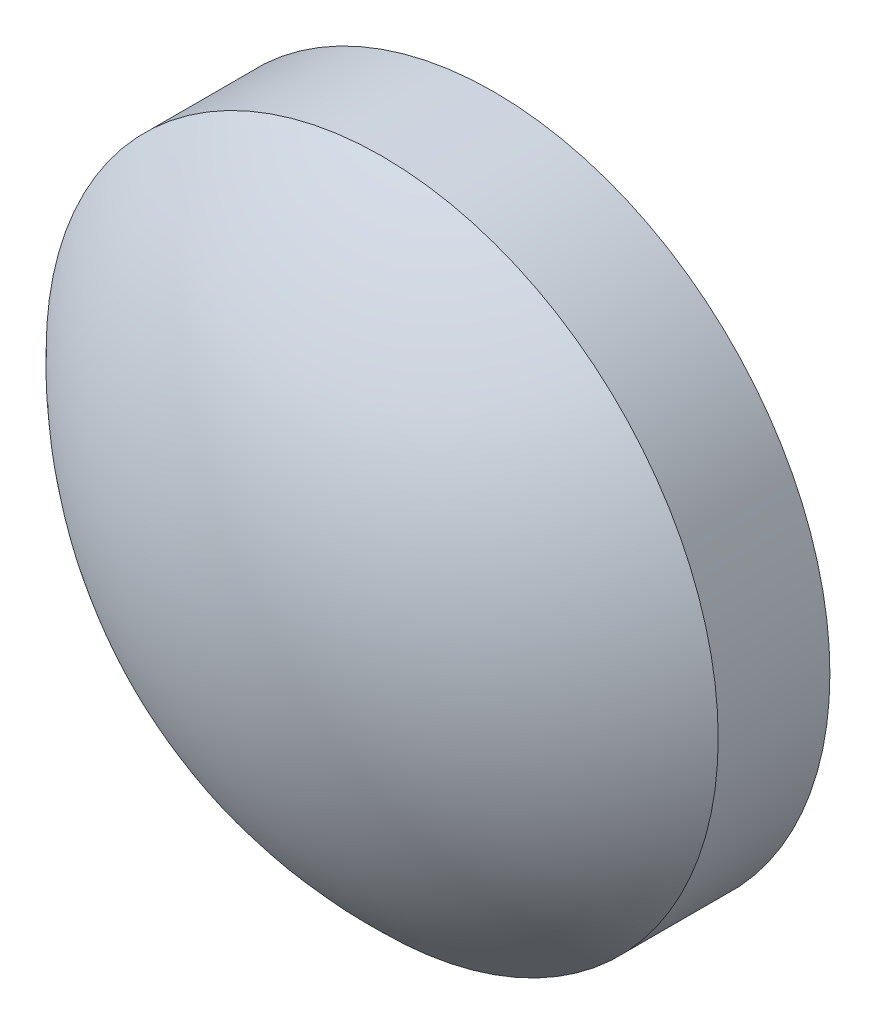
ISO-10303-21;
HEADER;
FILE_DESCRIPTION(('STEP AP214'),'2;1');
FILE_NAME('part.step','',(''),(''),'','','');
FILE_SCHEMA(('AUTOMOTIVE_DESIGN { 1 0 10303 214 1 1 1 1 }'));
ENDSEC;
DATA;
#1=APPLICATION_CONTEXT('core data for automotive mechanical design processes');
#2=APPLICATION_PROTOCOL_DEFINITION('international standard','automotive_design',2000,#1);
#3=PRODUCT_CONTEXT('',#1,'mechanical');
#4=PRODUCT('Part','Part','',(#3));
#5=PRODUCT_RELATED_PRODUCT_CATEGORY('part','',(#4));
#6=PRODUCT_DEFINITION_FORMATION('','',#4);
#7=PRODUCT_DEFINITION_CONTEXT('part definition',#1,'design');
#8=PRODUCT_DEFINITION('design','',#6,#7);
#9=PRODUCT_DEFINITION_SHAPE('','',#8);
#10=(LENGTH_UNIT() NAMED_UNIT(*) SI_UNIT(.MILLI.,.METRE.));
#11=(NAMED_UNIT(*) PLANE_ANGLE_UNIT() SI_UNIT($,.RADIAN.));
#12=(NAMED_UNIT(*) SI_UNIT($,.STERADIAN.) SOLID_ANGLE_UNIT());
#13=UNCERTAINTY_MEASURE_WITH_UNIT(LENGTH_MEASURE(1.E-05),#10,'distance_accuracy_value','');
#14=(GEOMETRIC_REPRESENTATION_CONTEXT(3) GLOBAL_UNCERTAINTY_ASSIGNED_CONTEXT((#13)) GLOBAL_UNIT_ASSIGNED_CONTEXT((#10,
#11,#12)) REPRESENTATION_CONTEXT('',''));
#15=CARTESIAN_POINT('',(0.,0.,0.));
#16=DIRECTION('',(0.,0.,1.));
#17=DIRECTION('',(1.,0.,0.));
#18=AXIS2_PLACEMENT_3D('',#15,#16,#17);
#19=CARTESIAN_POINT('',(0.,0.,-4.46));
#20=DIRECTION('',(0.,0.,1.));
#21=DIRECTION('',(0.,1.,0.));
#22=AXIS2_PLACEMENT_3D('',#19,#20,#21);
#23=SPHERICAL_SURFACE('',#22,6.18);
#24=CARTESIAN_POINT('',(0.,0.,-0.224152977266529));
#25=DIRECTION('',(0.,0.,1.));
#26=DIRECTION('',(1.,0.,0.));
#27=AXIS2_PLACEMENT_3D('',#24,#25,#26);
#28=CIRCLE('',#27,4.5);
#29=CARTESIAN_POINT('',(4.5,0.,-0.224152977266529));
#30=VERTEX_POINT('',#29);
#31=EDGE_CURVE('E8',#30,#30,#28,.T.);
#32=ORIENTED_EDGE('',*,*,#31,.T.);
#33=EDGE_LOOP('',(#32));
#34=FACE_BOUND('',#33,.T.);
#35=ADVANCED_FACE('F12',(#34),#23,.T.);
#36=CARTESIAN_POINT('',(0.,0.,4.30813204540037));
#37=DIRECTION('',(0.,0.,1.));
#38=DIRECTION('',(1.,0.,0.));
#39=AXIS2_PLACEMENT_3D('',#36,#37,#38);
#40=CYLINDRICAL_SURFACE('',#39,4.5);
#41=ORIENTED_EDGE('',*,*,#31,.F.);
#42=EDGE_LOOP('',(#41));
#43=FACE_BOUND('',#42,.T.);
#44=CARTESIAN_POINT('',(0.,0.,-1.72));
#45=DIRECTION('',(0.,0.,1.));
#46=DIRECTION('',(1.,0.,0.));
#47=AXIS2_PLACEMENT_3D('',#44,#45,#46);
#48=CIRCLE('',#47,4.5);
#49=CARTESIAN_POINT('',(4.5,0.,-1.72));
#50=VERTEX_POINT('',#49);
#51=EDGE_CURVE('E18',#50,#50,#48,.T.);
#52=ORIENTED_EDGE('',*,*,#51,.T.);
#53=EDGE_LOOP('',(#52));
#54=FACE_BOUND('',#53,.T.);
#55=ADVANCED_FACE('F24',(#43,#54),#40,.T.);
#56=CARTESIAN_POINT('',(0.,0.,-1.72));
#57=DIRECTION('',(0.,0.,1.));
#58=DIRECTION('',(1.,0.,0.));
#59=AXIS2_PLACEMENT_3D('',#56,#57,#58);
#60=PLANE('',#59);
#61=ORIENTED_EDGE('',*,*,#51,.F.);
#62=EDGE_LOOP('',(#61));
#63=FACE_BOUND('',#62,.T.);
#64=ADVANCED_FACE('F26',(#63),#60,.F.);
#65=CLOSED_SHELL('',(#35,#55,#64));
#66=MANIFOLD_SOLID_BREP('B1',#65);
#67=ADVANCED_BREP_SHAPE_REPRESENTATION('',(#18,#66),#14);
#68=SHAPE_DEFINITION_REPRESENTATION(#9,#67);
ENDSEC;
END-ISO-10303-21;
